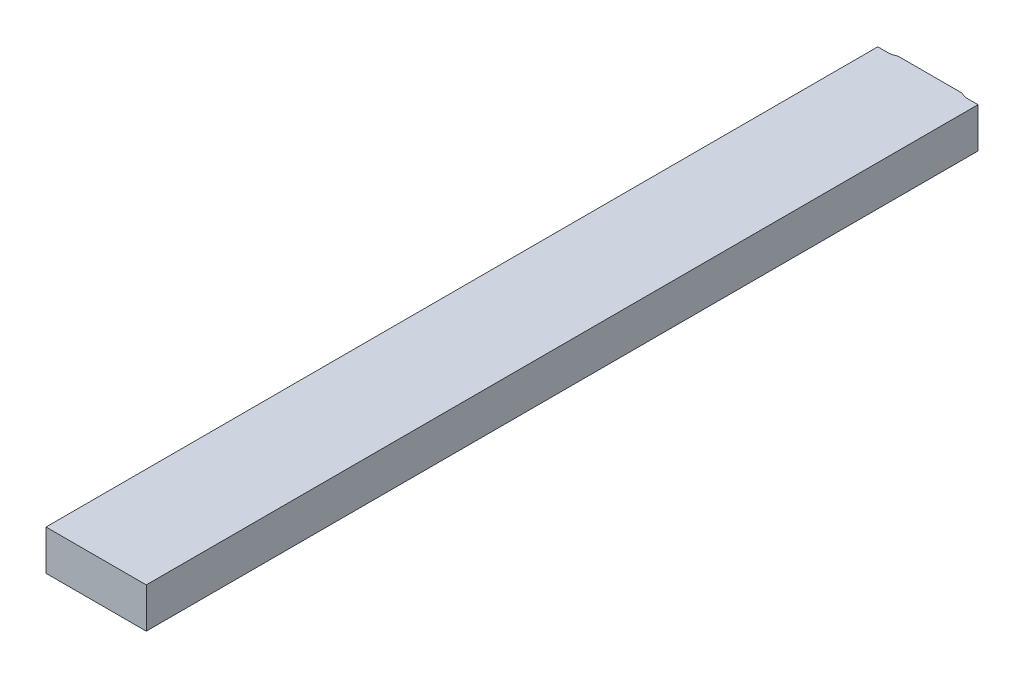
ISO-10303-21;
HEADER;
FILE_DESCRIPTION(('STEP AP214'),'2;1');
FILE_NAME('part.step','',(''),(''),'','','');
FILE_SCHEMA(('AUTOMOTIVE_DESIGN { 1 0 10303 214 1 1 1 1 }'));
ENDSEC;
DATA;
#1=APPLICATION_CONTEXT('core data for automotive mechanical design processes');
#2=APPLICATION_PROTOCOL_DEFINITION('international standard','automotive_design',2000,#1);
#3=PRODUCT_CONTEXT('',#1,'mechanical');
#4=PRODUCT('Part','Part','',(#3));
#5=PRODUCT_RELATED_PRODUCT_CATEGORY('part','',(#4));
#6=PRODUCT_DEFINITION_FORMATION('','',#4);
#7=PRODUCT_DEFINITION_CONTEXT('part definition',#1,'design');
#8=PRODUCT_DEFINITION('design','',#6,#7);
#9=PRODUCT_DEFINITION_SHAPE('','',#8);
#10=(LENGTH_UNIT() NAMED_UNIT(*) SI_UNIT(.MILLI.,.METRE.));
#11=(NAMED_UNIT(*) PLANE_ANGLE_UNIT() SI_UNIT($,.RADIAN.));
#12=(NAMED_UNIT(*) SI_UNIT($,.STERADIAN.) SOLID_ANGLE_UNIT());
#13=UNCERTAINTY_MEASURE_WITH_UNIT(LENGTH_MEASURE(1.E-05),#10,'distance_accuracy_value','');
#14=(GEOMETRIC_REPRESENTATION_CONTEXT(3) GLOBAL_UNCERTAINTY_ASSIGNED_CONTEXT((#13)) GLOBAL_UNIT_ASSIGNED_CONTEXT((#10,
#11,#12)) REPRESENTATION_CONTEXT('',''));
#15=CARTESIAN_POINT('',(0.,0.,0.));
#16=DIRECTION('',(0.,0.,1.));
#17=DIRECTION('',(1.,0.,0.));
#18=AXIS2_PLACEMENT_3D('',#15,#16,#17);
#19=CARTESIAN_POINT('',(-2.5,0.275,-4.982138483571));
#20=DIRECTION('',(0.,1.,0.));
#21=DIRECTION('',(0.,0.,1.));
#22=AXIS2_PLACEMENT_3D('',#19,#20,#21);
#23=PLANE('',#22);
#24=DIRECTION('',(1.,0.,0.));
#25=VECTOR('',#24,1.);
#26=CARTESIAN_POINT('',(-2.725,0.275,-7.051158663985));
#27=LINE('',#26,#25);
#28=CARTESIAN_POINT('',(-2.75,0.275,-7.051158663985));
#29=VERTEX_POINT('',#28);
#30=CARTESIAN_POINT('',(-2.69999999999826,0.275,-7.05115866398515));
#31=VERTEX_POINT('',#30);
#32=EDGE_CURVE('E184',#29,#31,#27,.T.);
#33=ORIENTED_EDGE('',*,*,#32,.T.);
#34=CARTESIAN_POINT('',(-2.66074390617903,0.275,-7.06145062487903));
#35=CARTESIAN_POINT('',(-2.66430562065387,0.275,-7.05943829430754));
#36=CARTESIAN_POINT('',(-2.66802308541288,0.275,-7.05770911016996));
#37=CARTESIAN_POINT('',(-2.675678668398,0.275,-7.05483826908998));
#38=CARTESIAN_POINT('',(-2.67961678669287,0.275,-7.05369661233063));
#39=CARTESIAN_POINT('',(-2.68899940611308,0.275,-7.05173413514556));
#40=CARTESIAN_POINT('',(-2.6944962200161,0.275,-7.05115865434742));
#41=CARTESIAN_POINT('',(-2.69999999999652,0.275,-7.0511586639853));
#42=B_SPLINE_CURVE_WITH_KNOTS('',3,(#34,#35,#36,#37,#38,#39,#40,#41),.UNSPECIFIED.,.F.,.F.,(4,2,
2,4),(0.,0.0122542009828672,0.0245084057837978,0.040976648284796),.UNSPECIFIED.);
#43=CARTESIAN_POINT('',(-2.66074390617903,0.275,-7.06145062487903));
#44=VERTEX_POINT('',#43);
#45=EDGE_CURVE('E93',#44,#31,#42,.T.);
#46=ORIENTED_EDGE('',*,*,#45,.F.);
#47=DIRECTION('',(1.,0.,0.));
#48=VECTOR('',#47,1.);
#49=CARTESIAN_POINT('',(-2.499999951796,0.275,-7.061450624879));
#50=LINE('',#49,#48);
#51=CARTESIAN_POINT('',(-2.339255997412,0.275,-7.06145062487899));
#52=VERTEX_POINT('',#51);
#53=EDGE_CURVE('E89',#44,#52,#50,.T.);
#54=ORIENTED_EDGE('',*,*,#53,.T.);
#55=CARTESIAN_POINT('',(-2.30000000000351,0.275,-7.05115866398509));
#56=CARTESIAN_POINT('',(-2.30408879277279,0.275,-7.05116284562048));
#57=CARTESIAN_POINT('',(-2.30817611333355,0.275,-7.05148113218099));
#58=CARTESIAN_POINT('',(-2.31625667415824,0.275,-7.05273057454798));
#59=CARTESIAN_POINT('',(-2.32024989952299,0.275,-7.05366182674584));
#60=CARTESIAN_POINT('',(-2.32939082766556,0.275,-7.05654480111922));
#61=CARTESIAN_POINT('',(-2.33446335028937,0.275,-7.05873731135742));
#62=CARTESIAN_POINT('',(-2.339255997412,0.275,-7.06145062487899));
#63=B_SPLINE_CURVE_WITH_KNOTS('',3,(#55,#56,#57,#58,#59,#60,#61,#62),.UNSPECIFIED.,.F.,.F.,(4,2,
2,4),(0.,0.0122527379750514,0.024507403204496,0.0409759652394023),.UNSPECIFIED.);
#64=CARTESIAN_POINT('',(-2.30000000000175,0.275,-7.05115866398504));
#65=VERTEX_POINT('',#64);
#66=EDGE_CURVE('E21',#65,#52,#63,.T.);
#67=ORIENTED_EDGE('',*,*,#66,.F.);
#68=DIRECTION('',(1.,0.,0.));
#69=VECTOR('',#68,1.);
#70=CARTESIAN_POINT('',(-2.275,0.275,-7.051158663985));
#71=LINE('',#70,#69);
#72=CARTESIAN_POINT('',(-2.25,0.275,-7.051158663985));
#73=VERTEX_POINT('',#72);
#74=EDGE_CURVE('E84',#65,#73,#71,.T.);
#75=ORIENTED_EDGE('',*,*,#74,.T.);
#76=DIRECTION('',(0.,0.,-1.));
#77=VECTOR('',#76,1.);
#78=CARTESIAN_POINT('',(-2.25,0.275,-4.976992503125));
#79=LINE('',#78,#77);
#80=CARTESIAN_POINT('',(-2.25,0.275,-2.902826342264));
#81=VERTEX_POINT('',#80);
#82=EDGE_CURVE('E218',#81,#73,#79,.T.);
#83=ORIENTED_EDGE('',*,*,#82,.F.);
#84=DIRECTION('',(1.,0.,0.));
#85=VECTOR('',#84,1.);
#86=CARTESIAN_POINT('',(-2.5,0.275,-2.902826342264));
#87=LINE('',#86,#85);
#88=CARTESIAN_POINT('',(-2.75,0.275,-2.902826342264));
#89=VERTEX_POINT('',#88);
#90=EDGE_CURVE('E204',#89,#81,#87,.T.);
#91=ORIENTED_EDGE('',*,*,#90,.F.);
#92=DIRECTION('',(0.,0.,-1.));
#93=VECTOR('',#92,1.);
#94=CARTESIAN_POINT('',(-2.75,0.275,-4.976992503125));
#95=LINE('',#94,#93);
#96=EDGE_CURVE('E176',#89,#29,#95,.T.);
#97=ORIENTED_EDGE('',*,*,#96,.T.);
#98=EDGE_LOOP('',(#33,#46,#54,#67,#75,#83,#91,#97));
#99=FACE_BOUND('',#98,.T.);
#100=ADVANCED_FACE('F17',(#99),#23,.F.);
#101=CARTESIAN_POINT('',(-2.25,0.375,-4.976992503125));
#102=DIRECTION('',(1.,0.,0.));
#103=DIRECTION('',(0.,0.,-1.));
#104=AXIS2_PLACEMENT_3D('',#101,#102,#103);
#105=PLANE('',#104);
#106=DIRECTION('',(0.,0.,1.));
#107=VECTOR('',#106,1.);
#108=CARTESIAN_POINT('',(-2.25,0.475,-4.982138483571));
#109=LINE('',#108,#107);
#110=CARTESIAN_POINT('',(-2.25,0.475,-2.902826342264));
#111=VERTEX_POINT('',#110);
#112=CARTESIAN_POINT('',(-2.25,0.475,-7.051158663985));
#113=VERTEX_POINT('',#112);
#114=EDGE_CURVE('E189',#111,#113,#109,.F.);
#115=ORIENTED_EDGE('',*,*,#114,.F.);
#116=DIRECTION('',(0.,1.,0.));
#117=VECTOR('',#116,1.);
#118=CARTESIAN_POINT('',(-2.25,0.375,-2.902826342264));
#119=LINE('',#118,#117);
#120=EDGE_CURVE('E203',#81,#111,#119,.T.);
#121=ORIENTED_EDGE('',*,*,#120,.F.);
#122=ORIENTED_EDGE('',*,*,#82,.T.);
#123=DIRECTION('',(0.,1.,0.));
#124=VECTOR('',#123,1.);
#125=CARTESIAN_POINT('',(-2.25,0.375,-7.051158663985));
#126=LINE('',#125,#124);
#127=EDGE_CURVE('E233',#73,#113,#126,.T.);
#128=ORIENTED_EDGE('',*,*,#127,.T.);
#129=EDGE_LOOP('',(#115,#121,#122,#128));
#130=FACE_BOUND('',#129,.T.);
#131=ADVANCED_FACE('F238',(#130),#105,.T.);
#132=CARTESIAN_POINT('',(-2.275,0.375,-7.051158663985));
#133=DIRECTION('',(0.,0.,1.));
#134=DIRECTION('',(1.,0.,0.));
#135=AXIS2_PLACEMENT_3D('',#132,#133,#134);
#136=PLANE('',#135);
#137=DIRECTION('',(1.,0.,0.));
#138=VECTOR('',#137,1.);
#139=CARTESIAN_POINT('',(-2.5,0.475,-7.051158663985));
#140=LINE('',#139,#138);
#141=CARTESIAN_POINT('',(-2.30000007335933,0.475,-7.05115866418437));
#142=VERTEX_POINT('',#141);
#143=EDGE_CURVE('E135',#113,#142,#140,.F.);
#144=ORIENTED_EDGE('',*,*,#143,.F.);
#145=ORIENTED_EDGE('',*,*,#127,.F.);
#146=ORIENTED_EDGE('',*,*,#74,.F.);
#147=DIRECTION('',(0.,1.,0.));
#148=VECTOR('',#147,1.);
#149=CARTESIAN_POINT('',(-2.3,0.2699679840491,-7.05115866398508));
#150=LINE('',#149,#148);
#151=EDGE_CURVE('E103',#142,#65,#150,.F.);
#152=ORIENTED_EDGE('',*,*,#151,.F.);
#153=EDGE_LOOP('',(#144,#145,#146,#152));
#154=FACE_BOUND('',#153,.T.);
#155=ADVANCED_FACE('F125',(#154),#136,.F.);
#156=CARTESIAN_POINT('',(-2.29748039058,0.2699679840491,-7.051190309039));
#157=CARTESIAN_POINT('',(-2.29831958238,0.2699679840491,-7.051166943388));
#158=CARTESIAN_POINT('',(-2.304384997637,0.2699679840491,-7.051090682037));
#159=CARTESIAN_POINT('',(-2.315708586206,0.2699679840491,-7.052195104335));
#160=CARTESIAN_POINT('',(-2.328858649665,0.2699679840491,-7.056177217872));
#161=CARTESIAN_POINT('',(-2.337975877851,0.2699679840491,-7.060613467733));
#162=CARTESIAN_POINT('',(-2.342157497933,0.2699679840491,-7.063145821386));
#163=CARTESIAN_POINT('',(-2.343566222697,0.2699679840491,-7.064061090588));
#164=(BOUNDED_CURVE() B_SPLINE_CURVE(3,(#156,#157,#158,#159,#160,#161,#162,#163),.UNSPECIFIED.,
.F.,.F.) B_SPLINE_CURVE_WITH_KNOTS((4,1,1,1,1,4),(0.,0.05196482602246,0.3752098129395,
0.6983604955075,0.8962889073999,1.),
.UNSPECIFIED.) CURVE() GEOMETRIC_REPRESENTATION_ITEM() RATIONAL_B_SPLINE_CURVE((1.,1.,1.,1.,1.,
1.,1.,1.)) REPRESENTATION_ITEM(''));
#165=DIRECTION('',(0.,1.,0.));
#166=VECTOR('',#165,1.);
#167=SURFACE_OF_LINEAR_EXTRUSION('',#164,#166);
#168=ORIENTED_EDGE('',*,*,#66,.T.);
#169=DIRECTION('',(0.,1.,0.));
#170=VECTOR('',#169,1.);
#171=CARTESIAN_POINT('',(-2.339255997412,0.375,-7.061450624879));
#172=LINE('',#171,#170);
#173=CARTESIAN_POINT('',(-2.339255997412,0.475,-7.061450624879));
#174=VERTEX_POINT('',#173);
#175=EDGE_CURVE('E97',#52,#174,#172,.T.);
#176=ORIENTED_EDGE('',*,*,#175,.T.);
#177=CARTESIAN_POINT('',(-2.30000014671866,0.475,-7.05115866438369));
#178=CARTESIAN_POINT('',(-2.30408893948173,0.475,-7.0511628532203));
#179=CARTESIAN_POINT('',(-2.30817625948792,0.475,-7.05148114713333));
#180=CARTESIAN_POINT('',(-2.3162568180645,0.475,-7.05273060421157));
#181=CARTESIAN_POINT('',(-2.3202500417355,0.475,-7.05366186376829));
#182=CARTESIAN_POINT('',(-2.32939091806165,0.475,-7.05654484039364));
#183=CARTESIAN_POINT('',(-2.33446339307278,0.475,-7.05873733584115));
#184=CARTESIAN_POINT('',(-2.339255997412,0.475,-7.06145062487899));
#185=B_SPLINE_CURVE_WITH_KNOTS('',3,(#177,#178,#179,#180,#181,#182,#183,#184),.UNSPECIFIED.,.F.,
.F.,(4,2,2,4),(0.,0.0122527379884836,0.0245074032339879,0.0409758193004658),.UNSPECIFIED.);
#186=EDGE_CURVE('E129',#142,#174,#185,.T.);
#187=ORIENTED_EDGE('',*,*,#186,.F.);
#188=ORIENTED_EDGE('',*,*,#151,.T.);
#189=EDGE_LOOP('',(#168,#176,#187,#188));
#190=FACE_BOUND('',#189,.T.);
#191=ADVANCED_FACE('F100',(#190),#167,.T.);
#192=CARTESIAN_POINT('',(-2.499999951796,0.375,-7.061450624879));
#193=DIRECTION('',(0.,0.,1.));
#194=DIRECTION('',(1.,0.,0.));
#195=AXIS2_PLACEMENT_3D('',#192,#193,#194);
#196=PLANE('',#195);
#197=ORIENTED_EDGE('',*,*,#53,.F.);
#198=DIRECTION('',(0.,1.,0.));
#199=VECTOR('',#198,1.);
#200=CARTESIAN_POINT('',(-2.66074390617902,0.2699679840491,-7.06145062487904));
#201=LINE('',#200,#199);
#202=CARTESIAN_POINT('',(-2.66074390617902,0.475,-7.06145062487903));
#203=VERTEX_POINT('',#202);
#204=EDGE_CURVE('E109',#203,#44,#201,.F.);
#205=ORIENTED_EDGE('',*,*,#204,.F.);
#206=DIRECTION('',(1.,0.,0.));
#207=VECTOR('',#206,1.);
#208=CARTESIAN_POINT('',(-2.5,0.475,-7.061450624879));
#209=LINE('',#208,#207);
#210=EDGE_CURVE('E106',#174,#203,#209,.F.);
#211=ORIENTED_EDGE('',*,*,#210,.F.);
#212=ORIENTED_EDGE('',*,*,#175,.F.);
#213=EDGE_LOOP('',(#197,#205,#211,#212));
#214=FACE_BOUND('',#213,.T.);
#215=ADVANCED_FACE('F104',(#214),#196,.F.);
#216=CARTESIAN_POINT('',(-2.656433692458,0.2699679840491,-7.064061118802));
#217=CARTESIAN_POINT('',(-2.65784241379,0.2699679840491,-7.063145841608));
#218=CARTESIAN_POINT('',(-2.662021892669,0.2699679840491,-7.060614746012));
#219=CARTESIAN_POINT('',(-2.67113801512,0.2699679840491,-7.056178456814));
#220=CARTESIAN_POINT('',(-2.684287959398,0.2699679840491,-7.052195755785));
#221=CARTESIAN_POINT('',(-2.695613253729,0.2699679840491,-7.051090694486));
#222=CARTESIAN_POINT('',(-2.701678868218,0.2699679840491,-7.051166937919));
#223=CARTESIAN_POINT('',(-2.702517288364,0.2699679840491,-7.051190272618));
#224=(BOUNDED_CURVE() B_SPLINE_CURVE(3,(#216,#217,#218,#219,#220,#221,#222,#223),.UNSPECIFIED.,
.F.,.F.) B_SPLINE_CURVE_WITH_KNOTS((4,1,1,1,1,4),(0.,0.1037158878781,0.3014998794713,
0.6247605212748,0.9480806664175,1.),
.UNSPECIFIED.) CURVE() GEOMETRIC_REPRESENTATION_ITEM() RATIONAL_B_SPLINE_CURVE((1.,1.,1.,1.,1.,
1.,1.,1.)) REPRESENTATION_ITEM(''));
#225=DIRECTION('',(0.,1.,0.));
#226=VECTOR('',#225,1.);
#227=SURFACE_OF_LINEAR_EXTRUSION('',#224,#226);
#228=CARTESIAN_POINT('',(-2.66074390617903,0.475,-7.06145062487904));
#229=CARTESIAN_POINT('',(-2.66430562063098,0.475,-7.05943829433274));
#230=CARTESIAN_POINT('',(-2.66802308540143,0.475,-7.05770911018256));
#231=CARTESIAN_POINT('',(-2.67567866840944,0.475,-7.05483826907738));
#232=CARTESIAN_POINT('',(-2.67961678671575,0.475,-7.05369661230544));
#233=CARTESIAN_POINT('',(-2.68899935836828,0.475,-7.05173414515934));
#234=CARTESIAN_POINT('',(-2.69449612238526,0.475,-7.05115866469184));
#235=CARTESIAN_POINT('',(-2.69999985318857,0.475,-7.05115866438328));
#236=B_SPLINE_CURVE_WITH_KNOTS('',3,(#228,#229,#230,#231,#232,#233,#234,#235),.UNSPECIFIED.,.F.,
.F.,(4,2,2,4),(0.,0.0122542009828672,0.024508405783798,0.0409765022206896),.UNSPECIFIED.);
#237=CARTESIAN_POINT('',(-2.7,0.475,-7.051158663985));
#238=VERTEX_POINT('',#237);
#239=EDGE_CURVE('E136',#203,#238,#236,.T.);
#240=ORIENTED_EDGE('',*,*,#239,.F.);
#241=ORIENTED_EDGE('',*,*,#204,.T.);
#242=ORIENTED_EDGE('',*,*,#45,.T.);
#243=DIRECTION('',(0.,1.,0.));
#244=VECTOR('',#243,1.);
#245=CARTESIAN_POINT('',(-2.7,0.375,-7.051158663985));
#246=LINE('',#245,#244);
#247=EDGE_CURVE('E182',#31,#238,#246,.T.);
#248=ORIENTED_EDGE('',*,*,#247,.T.);
#249=EDGE_LOOP('',(#240,#241,#242,#248));
#250=FACE_BOUND('',#249,.T.);
#251=ADVANCED_FACE('F159',(#250),#227,.T.);
#252=CARTESIAN_POINT('',(-2.725,0.375,-7.051158663985));
#253=DIRECTION('',(0.,0.,1.));
#254=DIRECTION('',(1.,0.,0.));
#255=AXIS2_PLACEMENT_3D('',#252,#253,#254);
#256=PLANE('',#255);
#257=DIRECTION('',(1.,0.,0.));
#258=VECTOR('',#257,1.);
#259=CARTESIAN_POINT('',(-2.5,0.475,-7.051158663985));
#260=LINE('',#259,#258);
#261=CARTESIAN_POINT('',(-2.75,0.475,-7.051158663985));
#262=VERTEX_POINT('',#261);
#263=EDGE_CURVE('E181',#238,#262,#260,.F.);
#264=ORIENTED_EDGE('',*,*,#263,.F.);
#265=ORIENTED_EDGE('',*,*,#247,.F.);
#266=ORIENTED_EDGE('',*,*,#32,.F.);
#267=DIRECTION('',(0.,1.,0.));
#268=VECTOR('',#267,1.);
#269=CARTESIAN_POINT('',(-2.75,0.375,-7.051158663985));
#270=LINE('',#269,#268);
#271=EDGE_CURVE('E174',#29,#262,#270,.T.);
#272=ORIENTED_EDGE('',*,*,#271,.T.);
#273=EDGE_LOOP('',(#264,#265,#266,#272));
#274=FACE_BOUND('',#273,.T.);
#275=ADVANCED_FACE('F157',(#274),#256,.F.);
#276=CARTESIAN_POINT('',(-2.75,0.375,-4.976992503125));
#277=DIRECTION('',(1.,0.,0.));
#278=DIRECTION('',(0.,0.,-1.));
#279=AXIS2_PLACEMENT_3D('',#276,#277,#278);
#280=PLANE('',#279);
#281=ORIENTED_EDGE('',*,*,#271,.F.);
#282=ORIENTED_EDGE('',*,*,#96,.F.);
#283=DIRECTION('',(0.,1.,0.));
#284=VECTOR('',#283,1.);
#285=CARTESIAN_POINT('',(-2.75,0.375,-2.902826342264));
#286=LINE('',#285,#284);
#287=CARTESIAN_POINT('',(-2.75,0.475,-2.902826342264));
#288=VERTEX_POINT('',#287);
#289=EDGE_CURVE('E40',#288,#89,#286,.F.);
#290=ORIENTED_EDGE('',*,*,#289,.F.);
#291=DIRECTION('',(0.,0.,1.));
#292=VECTOR('',#291,1.);
#293=CARTESIAN_POINT('',(-2.75,0.475,-4.982138483571));
#294=LINE('',#293,#292);
#295=EDGE_CURVE('E31',#262,#288,#294,.T.);
#296=ORIENTED_EDGE('',*,*,#295,.F.);
#297=EDGE_LOOP('',(#281,#282,#290,#296));
#298=FACE_BOUND('',#297,.T.);
#299=ADVANCED_FACE('F153',(#298),#280,.F.);
#300=CARTESIAN_POINT('',(-2.5,0.375,-2.902826342264));
#301=DIRECTION('',(0.,0.,1.));
#302=DIRECTION('',(1.,0.,0.));
#303=AXIS2_PLACEMENT_3D('',#300,#301,#302);
#304=PLANE('',#303);
#305=ORIENTED_EDGE('',*,*,#120,.T.);
#306=DIRECTION('',(1.,0.,0.));
#307=VECTOR('',#306,1.);
#308=CARTESIAN_POINT('',(-2.5,0.475,-2.902826342264));
#309=LINE('',#308,#307);
#310=EDGE_CURVE('E11',#288,#111,#309,.T.);
#311=ORIENTED_EDGE('',*,*,#310,.F.);
#312=ORIENTED_EDGE('',*,*,#289,.T.);
#313=ORIENTED_EDGE('',*,*,#90,.T.);
#314=EDGE_LOOP('',(#305,#311,#312,#313));
#315=FACE_BOUND('',#314,.T.);
#316=ADVANCED_FACE('F148',(#315),#304,.T.);
#317=CARTESIAN_POINT('',(-2.5,0.475,-4.982138483571));
#318=DIRECTION('',(0.,1.,0.));
#319=DIRECTION('',(0.,0.,1.));
#320=AXIS2_PLACEMENT_3D('',#317,#318,#319);
#321=PLANE('',#320);
#322=ORIENTED_EDGE('',*,*,#295,.T.);
#323=ORIENTED_EDGE('',*,*,#310,.T.);
#324=ORIENTED_EDGE('',*,*,#114,.T.);
#325=ORIENTED_EDGE('',*,*,#143,.T.);
#326=ORIENTED_EDGE('',*,*,#186,.T.);
#327=ORIENTED_EDGE('',*,*,#210,.T.);
#328=ORIENTED_EDGE('',*,*,#239,.T.);
#329=ORIENTED_EDGE('',*,*,#263,.T.);
#330=EDGE_LOOP('',(#322,#323,#324,#325,#326,#327,#328,#329));
#331=FACE_BOUND('',#330,.T.);
#332=ADVANCED_FACE('F144',(#331),#321,.T.);
#333=CLOSED_SHELL('',(#100,#131,#155,#191,#215,#251,#275,#299,#316,#332));
#334=MANIFOLD_SOLID_BREP('B1',#333);
#335=ADVANCED_BREP_SHAPE_REPRESENTATION('',(#18,#334),#14);
#336=SHAPE_DEFINITION_REPRESENTATION(#9,#335);
ENDSEC;
END-ISO-10303-21;
